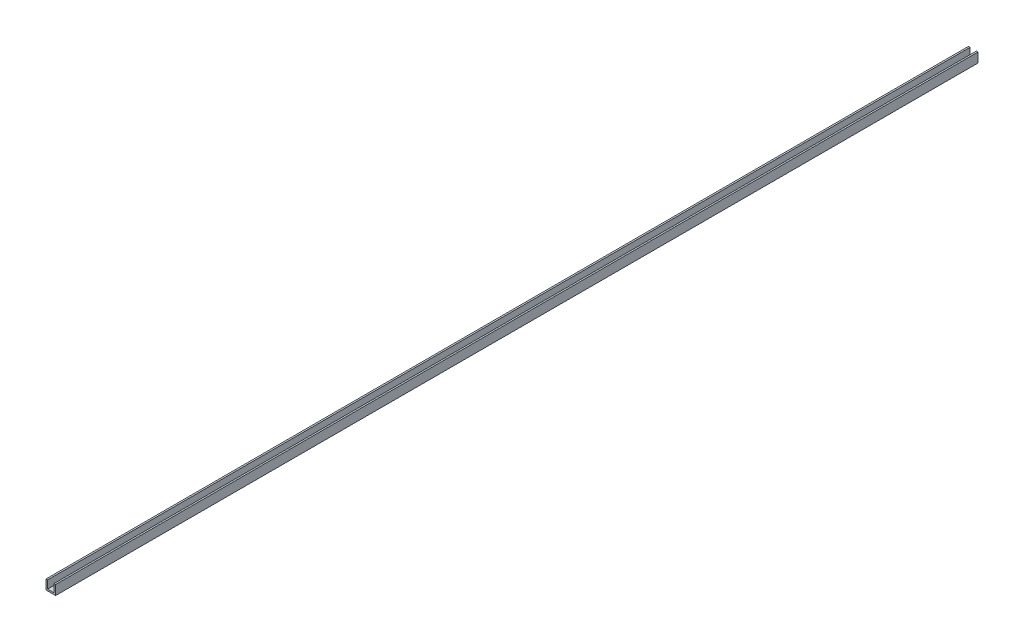
ISO-10303-21;
HEADER;
FILE_DESCRIPTION(('STEP AP214'),'2;1');
FILE_NAME('part.step','',(''),(''),'','','');
FILE_SCHEMA(('AUTOMOTIVE_DESIGN { 1 0 10303 214 1 1 1 1 }'));
ENDSEC;
DATA;
#1=APPLICATION_CONTEXT('core data for automotive mechanical design processes');
#2=APPLICATION_PROTOCOL_DEFINITION('international standard','automotive_design',2000,#1);
#3=PRODUCT_CONTEXT('',#1,'mechanical');
#4=PRODUCT('Part','Part','',(#3));
#5=PRODUCT_RELATED_PRODUCT_CATEGORY('part','',(#4));
#6=PRODUCT_DEFINITION_FORMATION('','',#4);
#7=PRODUCT_DEFINITION_CONTEXT('part definition',#1,'design');
#8=PRODUCT_DEFINITION('design','',#6,#7);
#9=PRODUCT_DEFINITION_SHAPE('','',#8);
#10=(LENGTH_UNIT() NAMED_UNIT(*) SI_UNIT(.MILLI.,.METRE.));
#11=(NAMED_UNIT(*) PLANE_ANGLE_UNIT() SI_UNIT($,.RADIAN.));
#12=(NAMED_UNIT(*) SI_UNIT($,.STERADIAN.) SOLID_ANGLE_UNIT());
#13=UNCERTAINTY_MEASURE_WITH_UNIT(LENGTH_MEASURE(1.E-05),#10,'distance_accuracy_value','');
#14=(GEOMETRIC_REPRESENTATION_CONTEXT(3) GLOBAL_UNCERTAINTY_ASSIGNED_CONTEXT((#13)) GLOBAL_UNIT_ASSIGNED_CONTEXT((#10,
#11,#12)) REPRESENTATION_CONTEXT('',''));
#15=CARTESIAN_POINT('',(0.,0.,0.));
#16=DIRECTION('',(0.,0.,1.));
#17=DIRECTION('',(1.,0.,0.));
#18=AXIS2_PLACEMENT_3D('',#15,#16,#17);
#19=CARTESIAN_POINT('',(3.175,0.,1828.8));
#20=DIRECTION('',(0.,-1.,0.));
#21=DIRECTION('',(0.,0.,-1.));
#22=AXIS2_PLACEMENT_3D('',#19,#20,#21);
#23=PLANE('',#22);
#24=DIRECTION('',(-1.,0.,0.));
#25=VECTOR('',#24,1.);
#26=CARTESIAN_POINT('',(3.175,0.,0.));
#27=LINE('',#26,#25);
#28=CARTESIAN_POINT('',(3.175,0.,0.));
#29=VERTEX_POINT('',#28);
#30=CARTESIAN_POINT('',(0.,0.,0.));
#31=VERTEX_POINT('',#30);
#32=EDGE_CURVE('E133',#29,#31,#27,.T.);
#33=ORIENTED_EDGE('',*,*,#32,.T.);
#34=DIRECTION('',(0.,0.,-1.));
#35=VECTOR('',#34,1.);
#36=CARTESIAN_POINT('',(0.,0.,1828.8));
#37=LINE('',#36,#35);
#38=CARTESIAN_POINT('',(0.,0.,1828.8));
#39=VERTEX_POINT('',#38);
#40=EDGE_CURVE('E11',#39,#31,#37,.T.);
#41=ORIENTED_EDGE('',*,*,#40,.F.);
#42=DIRECTION('',(-1.,0.,0.));
#43=VECTOR('',#42,1.);
#44=CARTESIAN_POINT('',(3.175,0.,1828.8));
#45=LINE('',#44,#43);
#46=CARTESIAN_POINT('',(3.175,0.,1828.8));
#47=VERTEX_POINT('',#46);
#48=EDGE_CURVE('E147',#47,#39,#45,.T.);
#49=ORIENTED_EDGE('',*,*,#48,.F.);
#50=DIRECTION('',(0.,0.,-1.));
#51=VECTOR('',#50,1.);
#52=CARTESIAN_POINT('',(3.175,0.,1828.8));
#53=LINE('',#52,#51);
#54=EDGE_CURVE('E129',#47,#29,#53,.T.);
#55=ORIENTED_EDGE('',*,*,#54,.T.);
#56=EDGE_LOOP('',(#33,#41,#49,#55));
#57=FACE_BOUND('',#56,.T.);
#58=ADVANCED_FACE('F37',(#57),#23,.F.);
#59=CARTESIAN_POINT('',(0.,0.,1828.8));
#60=DIRECTION('',(1.,0.,0.));
#61=DIRECTION('',(0.,1.,0.));
#62=AXIS2_PLACEMENT_3D('',#59,#60,#61);
#63=PLANE('',#62);
#64=DIRECTION('',(0.,-1.,0.));
#65=VECTOR('',#64,1.);
#66=CARTESIAN_POINT('',(0.,0.,0.));
#67=LINE('',#66,#65);
#68=CARTESIAN_POINT('',(0.,-19.05,0.));
#69=VERTEX_POINT('',#68);
#70=EDGE_CURVE('E136',#31,#69,#67,.T.);
#71=ORIENTED_EDGE('',*,*,#70,.T.);
#72=DIRECTION('',(0.,0.,-1.));
#73=VECTOR('',#72,1.);
#74=CARTESIAN_POINT('',(0.,-19.05,1828.8));
#75=LINE('',#74,#73);
#76=CARTESIAN_POINT('',(0.,-19.05,1828.8));
#77=VERTEX_POINT('',#76);
#78=EDGE_CURVE('E45',#77,#69,#75,.T.);
#79=ORIENTED_EDGE('',*,*,#78,.F.);
#80=DIRECTION('',(0.,-1.,0.));
#81=VECTOR('',#80,1.);
#82=CARTESIAN_POINT('',(0.,0.,1828.8));
#83=LINE('',#82,#81);
#84=EDGE_CURVE('E96',#39,#77,#83,.T.);
#85=ORIENTED_EDGE('',*,*,#84,.F.);
#86=ORIENTED_EDGE('',*,*,#40,.T.);
#87=EDGE_LOOP('',(#71,#79,#85,#86));
#88=FACE_BOUND('',#87,.T.);
#89=ADVANCED_FACE('F182',(#88),#63,.F.);
#90=CARTESIAN_POINT('',(0.,-19.05,1828.8));
#91=DIRECTION('',(0.,1.,0.));
#92=DIRECTION('',(0.,0.,1.));
#93=AXIS2_PLACEMENT_3D('',#90,#91,#92);
#94=PLANE('',#93);
#95=DIRECTION('',(1.,0.,0.));
#96=VECTOR('',#95,1.);
#97=CARTESIAN_POINT('',(0.,-19.05,0.));
#98=LINE('',#97,#96);
#99=CARTESIAN_POINT('',(19.05,-19.05,0.));
#100=VERTEX_POINT('',#99);
#101=EDGE_CURVE('E138',#69,#100,#98,.T.);
#102=ORIENTED_EDGE('',*,*,#101,.T.);
#103=DIRECTION('',(0.,0.,-1.));
#104=VECTOR('',#103,1.);
#105=CARTESIAN_POINT('',(19.05,-19.05,1828.8));
#106=LINE('',#105,#104);
#107=CARTESIAN_POINT('',(19.05,-19.05,1828.8));
#108=VERTEX_POINT('',#107);
#109=EDGE_CURVE('E154',#108,#100,#106,.T.);
#110=ORIENTED_EDGE('',*,*,#109,.F.);
#111=DIRECTION('',(1.,0.,0.));
#112=VECTOR('',#111,1.);
#113=CARTESIAN_POINT('',(0.,-19.05,1828.8));
#114=LINE('',#113,#112);
#115=EDGE_CURVE('E162',#77,#108,#114,.T.);
#116=ORIENTED_EDGE('',*,*,#115,.F.);
#117=ORIENTED_EDGE('',*,*,#78,.T.);
#118=EDGE_LOOP('',(#102,#110,#116,#117));
#119=FACE_BOUND('',#118,.T.);
#120=ADVANCED_FACE('F160',(#119),#94,.F.);
#121=CARTESIAN_POINT('',(19.05,-19.05,1828.8));
#122=DIRECTION('',(-1.,0.,0.));
#123=DIRECTION('',(0.,0.,1.));
#124=AXIS2_PLACEMENT_3D('',#121,#122,#123);
#125=PLANE('',#124);
#126=DIRECTION('',(0.,1.,0.));
#127=VECTOR('',#126,1.);
#128=CARTESIAN_POINT('',(19.05,-19.05,0.));
#129=LINE('',#128,#127);
#130=CARTESIAN_POINT('',(19.05,0.,0.));
#131=VERTEX_POINT('',#130);
#132=EDGE_CURVE('E140',#100,#131,#129,.T.);
#133=ORIENTED_EDGE('',*,*,#132,.T.);
#134=DIRECTION('',(0.,0.,-1.));
#135=VECTOR('',#134,1.);
#136=CARTESIAN_POINT('',(19.05,0.,1828.8));
#137=LINE('',#136,#135);
#138=CARTESIAN_POINT('',(19.05,0.,1828.8));
#139=VERTEX_POINT('',#138);
#140=EDGE_CURVE('E151',#139,#131,#137,.T.);
#141=ORIENTED_EDGE('',*,*,#140,.F.);
#142=DIRECTION('',(0.,1.,0.));
#143=VECTOR('',#142,1.);
#144=CARTESIAN_POINT('',(19.05,-19.05,1828.8));
#145=LINE('',#144,#143);
#146=EDGE_CURVE('E174',#108,#139,#145,.T.);
#147=ORIENTED_EDGE('',*,*,#146,.F.);
#148=ORIENTED_EDGE('',*,*,#109,.T.);
#149=EDGE_LOOP('',(#133,#141,#147,#148));
#150=FACE_BOUND('',#149,.T.);
#151=ADVANCED_FACE('F170',(#150),#125,.F.);
#152=CARTESIAN_POINT('',(19.05,0.,1828.8));
#153=DIRECTION('',(0.,-1.,0.));
#154=DIRECTION('',(1.,0.,0.));
#155=AXIS2_PLACEMENT_3D('',#152,#153,#154);
#156=PLANE('',#155);
#157=DIRECTION('',(-1.,0.,0.));
#158=VECTOR('',#157,1.);
#159=CARTESIAN_POINT('',(19.05,0.,0.));
#160=LINE('',#159,#158);
#161=CARTESIAN_POINT('',(15.875,0.,0.));
#162=VERTEX_POINT('',#161);
#163=EDGE_CURVE('E142',#131,#162,#160,.T.);
#164=ORIENTED_EDGE('',*,*,#163,.T.);
#165=DIRECTION('',(0.,0.,-1.));
#166=VECTOR('',#165,1.);
#167=CARTESIAN_POINT('',(15.875,0.,1828.8));
#168=LINE('',#167,#166);
#169=CARTESIAN_POINT('',(15.875,0.,1828.8));
#170=VERTEX_POINT('',#169);
#171=EDGE_CURVE('E124',#170,#162,#168,.T.);
#172=ORIENTED_EDGE('',*,*,#171,.F.);
#173=DIRECTION('',(-1.,0.,0.));
#174=VECTOR('',#173,1.);
#175=CARTESIAN_POINT('',(19.05,0.,1828.8));
#176=LINE('',#175,#174);
#177=EDGE_CURVE('E115',#139,#170,#176,.T.);
#178=ORIENTED_EDGE('',*,*,#177,.F.);
#179=ORIENTED_EDGE('',*,*,#140,.T.);
#180=EDGE_LOOP('',(#164,#172,#178,#179));
#181=FACE_BOUND('',#180,.T.);
#182=ADVANCED_FACE('F173',(#181),#156,.F.);
#183=CARTESIAN_POINT('',(15.875,0.,1828.8));
#184=DIRECTION('',(1.,0.,0.));
#185=DIRECTION('',(0.,1.,0.));
#186=AXIS2_PLACEMENT_3D('',#183,#184,#185);
#187=PLANE('',#186);
#188=DIRECTION('',(0.,-1.,0.));
#189=VECTOR('',#188,1.);
#190=CARTESIAN_POINT('',(15.875,0.,0.));
#191=LINE('',#190,#189);
#192=CARTESIAN_POINT('',(15.875,-15.875,0.));
#193=VERTEX_POINT('',#192);
#194=EDGE_CURVE('E123',#162,#193,#191,.T.);
#195=ORIENTED_EDGE('',*,*,#194,.T.);
#196=DIRECTION('',(0.,0.,-1.));
#197=VECTOR('',#196,1.);
#198=CARTESIAN_POINT('',(15.875,-15.875,1828.8));
#199=LINE('',#198,#197);
#200=CARTESIAN_POINT('',(15.875,-15.875,1828.8));
#201=VERTEX_POINT('',#200);
#202=EDGE_CURVE('E120',#201,#193,#199,.T.);
#203=ORIENTED_EDGE('',*,*,#202,.F.);
#204=DIRECTION('',(0.,-1.,0.));
#205=VECTOR('',#204,1.);
#206=CARTESIAN_POINT('',(15.875,0.,1828.8));
#207=LINE('',#206,#205);
#208=EDGE_CURVE('E109',#170,#201,#207,.T.);
#209=ORIENTED_EDGE('',*,*,#208,.F.);
#210=ORIENTED_EDGE('',*,*,#171,.T.);
#211=EDGE_LOOP('',(#195,#203,#209,#210));
#212=FACE_BOUND('',#211,.T.);
#213=ADVANCED_FACE('F121',(#212),#187,.F.);
#214=CARTESIAN_POINT('',(15.875,-15.875,1828.8));
#215=DIRECTION('',(0.,-1.,0.));
#216=DIRECTION('',(0.,0.,-1.));
#217=AXIS2_PLACEMENT_3D('',#214,#215,#216);
#218=PLANE('',#217);
#219=DIRECTION('',(-1.,0.,0.));
#220=VECTOR('',#219,1.);
#221=CARTESIAN_POINT('',(15.875,-15.875,0.));
#222=LINE('',#221,#220);
#223=CARTESIAN_POINT('',(3.175,-15.875,0.));
#224=VERTEX_POINT('',#223);
#225=EDGE_CURVE('E82',#193,#224,#222,.T.);
#226=ORIENTED_EDGE('',*,*,#225,.T.);
#227=DIRECTION('',(0.,0.,-1.));
#228=VECTOR('',#227,1.);
#229=CARTESIAN_POINT('',(3.175,-15.875,1828.8));
#230=LINE('',#229,#228);
#231=CARTESIAN_POINT('',(3.175,-15.875,1828.8));
#232=VERTEX_POINT('',#231);
#233=EDGE_CURVE('E125',#232,#224,#230,.T.);
#234=ORIENTED_EDGE('',*,*,#233,.F.);
#235=DIRECTION('',(-1.,0.,0.));
#236=VECTOR('',#235,1.);
#237=CARTESIAN_POINT('',(15.875,-15.875,1828.8));
#238=LINE('',#237,#236);
#239=EDGE_CURVE('E113',#201,#232,#238,.T.);
#240=ORIENTED_EDGE('',*,*,#239,.F.);
#241=ORIENTED_EDGE('',*,*,#202,.T.);
#242=EDGE_LOOP('',(#226,#234,#240,#241));
#243=FACE_BOUND('',#242,.T.);
#244=ADVANCED_FACE('F127',(#243),#218,.F.);
#245=CARTESIAN_POINT('',(3.175,-15.875,1828.8));
#246=DIRECTION('',(-1.,0.,0.));
#247=DIRECTION('',(0.,0.,1.));
#248=AXIS2_PLACEMENT_3D('',#245,#246,#247);
#249=PLANE('',#248);
#250=DIRECTION('',(0.,1.,0.));
#251=VECTOR('',#250,1.);
#252=CARTESIAN_POINT('',(3.175,-15.875,0.));
#253=LINE('',#252,#251);
#254=EDGE_CURVE('E88',#224,#29,#253,.T.);
#255=ORIENTED_EDGE('',*,*,#254,.T.);
#256=ORIENTED_EDGE('',*,*,#54,.F.);
#257=DIRECTION('',(0.,1.,0.));
#258=VECTOR('',#257,1.);
#259=CARTESIAN_POINT('',(3.175,-15.875,1828.8));
#260=LINE('',#259,#258);
#261=EDGE_CURVE('E53',#232,#47,#260,.T.);
#262=ORIENTED_EDGE('',*,*,#261,.F.);
#263=ORIENTED_EDGE('',*,*,#233,.T.);
#264=EDGE_LOOP('',(#255,#256,#262,#263));
#265=FACE_BOUND('',#264,.T.);
#266=ADVANCED_FACE('F198',(#265),#249,.F.);
#267=CARTESIAN_POINT('',(0.,0.,1828.8));
#268=DIRECTION('',(0.,0.,1.));
#269=DIRECTION('',(1.,0.,0.));
#270=AXIS2_PLACEMENT_3D('',#267,#268,#269);
#271=PLANE('',#270);
#272=ORIENTED_EDGE('',*,*,#48,.T.);
#273=ORIENTED_EDGE('',*,*,#84,.T.);
#274=ORIENTED_EDGE('',*,*,#115,.T.);
#275=ORIENTED_EDGE('',*,*,#146,.T.);
#276=ORIENTED_EDGE('',*,*,#177,.T.);
#277=ORIENTED_EDGE('',*,*,#208,.T.);
#278=ORIENTED_EDGE('',*,*,#239,.T.);
#279=ORIENTED_EDGE('',*,*,#261,.T.);
#280=EDGE_LOOP('',(#272,#273,#274,#275,#276,#277,#278,#279));
#281=FACE_BOUND('',#280,.T.);
#282=ADVANCED_FACE('F111',(#281),#271,.T.);
#283=CARTESIAN_POINT('',(0.,0.,0.));
#284=DIRECTION('',(0.,0.,1.));
#285=DIRECTION('',(1.,0.,0.));
#286=AXIS2_PLACEMENT_3D('',#283,#284,#285);
#287=PLANE('',#286);
#288=ORIENTED_EDGE('',*,*,#32,.F.);
#289=ORIENTED_EDGE('',*,*,#254,.F.);
#290=ORIENTED_EDGE('',*,*,#225,.F.);
#291=ORIENTED_EDGE('',*,*,#194,.F.);
#292=ORIENTED_EDGE('',*,*,#163,.F.);
#293=ORIENTED_EDGE('',*,*,#132,.F.);
#294=ORIENTED_EDGE('',*,*,#101,.F.);
#295=ORIENTED_EDGE('',*,*,#70,.F.);
#296=EDGE_LOOP('',(#288,#289,#290,#291,#292,#293,#294,#295));
#297=FACE_BOUND('',#296,.T.);
#298=ADVANCED_FACE('F166',(#297),#287,.F.);
#299=CLOSED_SHELL('',(#58,#89,#120,#151,#182,#213,#244,#266,#282,#298));
#300=MANIFOLD_SOLID_BREP('B2',#299);
#301=ADVANCED_BREP_SHAPE_REPRESENTATION('',(#18,#300),#14);
#302=SHAPE_DEFINITION_REPRESENTATION(#9,#301);
ENDSEC;
END-ISO-10303-21;
